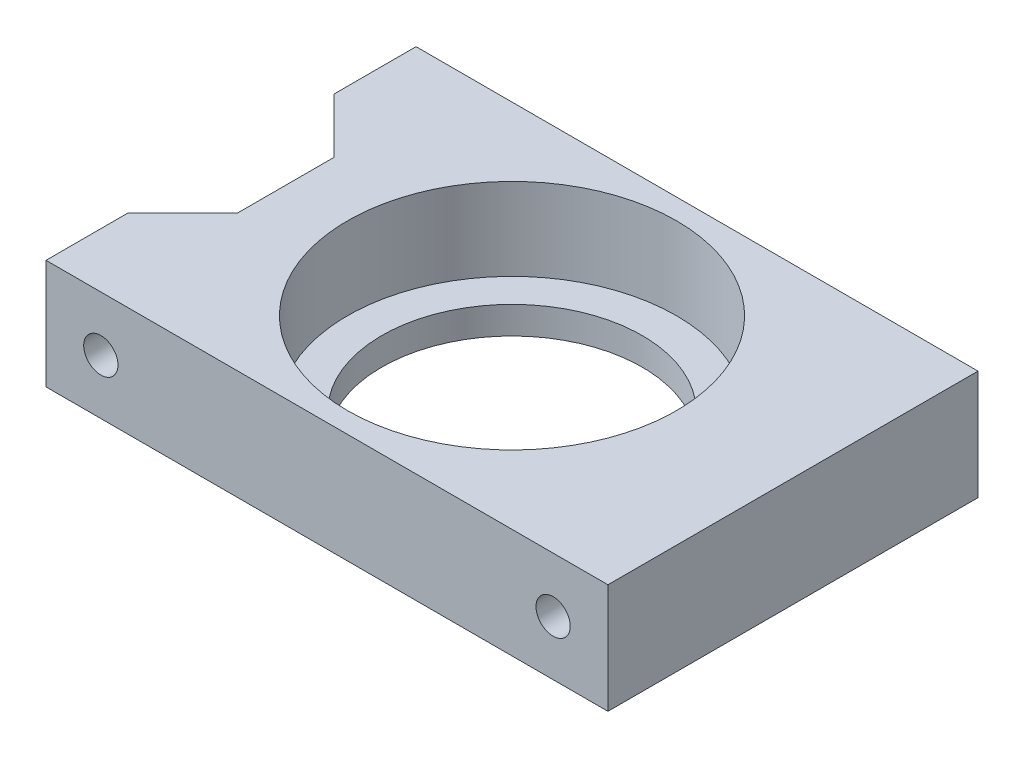
ISO-10303-21;
HEADER;
FILE_DESCRIPTION(('STEP AP214'),'2;1');
FILE_NAME('part.step','',(''),(''),'','','');
FILE_SCHEMA(('AUTOMOTIVE_DESIGN { 1 0 10303 214 1 1 1 1 }'));
ENDSEC;
DATA;
#1=APPLICATION_CONTEXT('core data for automotive mechanical design processes');
#2=APPLICATION_PROTOCOL_DEFINITION('international standard','automotive_design',2000,#1);
#3=PRODUCT_CONTEXT('',#1,'mechanical');
#4=PRODUCT('Part','Part','',(#3));
#5=PRODUCT_RELATED_PRODUCT_CATEGORY('part','',(#4));
#6=PRODUCT_DEFINITION_FORMATION('','',#4);
#7=PRODUCT_DEFINITION_CONTEXT('part definition',#1,'design');
#8=PRODUCT_DEFINITION('design','',#6,#7);
#9=PRODUCT_DEFINITION_SHAPE('','',#8);
#10=(LENGTH_UNIT() NAMED_UNIT(*) SI_UNIT(.MILLI.,.METRE.));
#11=(NAMED_UNIT(*) PLANE_ANGLE_UNIT() SI_UNIT($,.RADIAN.));
#12=(NAMED_UNIT(*) SI_UNIT($,.STERADIAN.) SOLID_ANGLE_UNIT());
#13=UNCERTAINTY_MEASURE_WITH_UNIT(LENGTH_MEASURE(1.E-05),#10,'distance_accuracy_value','');
#14=(GEOMETRIC_REPRESENTATION_CONTEXT(3) GLOBAL_UNCERTAINTY_ASSIGNED_CONTEXT((#13)) GLOBAL_UNIT_ASSIGNED_CONTEXT((#10,
#11,#12)) REPRESENTATION_CONTEXT('',''));
#15=CARTESIAN_POINT('',(0.,0.,0.));
#16=DIRECTION('',(0.,0.,1.));
#17=DIRECTION('',(1.,0.,0.));
#18=AXIS2_PLACEMENT_3D('',#15,#16,#17);
#19=CARTESIAN_POINT('',(-20.5,8.,13.5));
#20=DIRECTION('',(1.,0.,0.));
#21=DIRECTION('',(0.,0.,-1.));
#22=AXIS2_PLACEMENT_3D('',#19,#20,#21);
#23=PLANE('',#22);
#24=DIRECTION('',(0.,0.,1.));
#25=VECTOR('',#24,1.);
#26=CARTESIAN_POINT('',(-20.5,0.,13.5));
#27=LINE('',#26,#25);
#28=CARTESIAN_POINT('',(-20.5,0.,-13.5));
#29=VERTEX_POINT('',#28);
#30=CARTESIAN_POINT('',(-20.5,0.,-7.5));
#31=VERTEX_POINT('',#30);
#32=EDGE_CURVE('E171',#29,#31,#27,.T.);
#33=ORIENTED_EDGE('',*,*,#32,.T.);
#34=DIRECTION('',(0.,1.,0.));
#35=VECTOR('',#34,1.);
#36=CARTESIAN_POINT('',(-20.5,0.,-7.5));
#37=LINE('',#36,#35);
#38=CARTESIAN_POINT('',(-20.5,8.,-7.5));
#39=VERTEX_POINT('',#38);
#40=EDGE_CURVE('E143',#31,#39,#37,.T.);
#41=ORIENTED_EDGE('',*,*,#40,.T.);
#42=DIRECTION('',(0.,0.,1.));
#43=VECTOR('',#42,1.);
#44=CARTESIAN_POINT('',(-20.5,8.,13.5));
#45=LINE('',#44,#43);
#46=CARTESIAN_POINT('',(-20.5,8.,-13.5));
#47=VERTEX_POINT('',#46);
#48=EDGE_CURVE('E162',#47,#39,#45,.T.);
#49=ORIENTED_EDGE('',*,*,#48,.F.);
#50=DIRECTION('',(0.,-1.,0.));
#51=VECTOR('',#50,1.);
#52=CARTESIAN_POINT('',(-20.5,8.,-13.5));
#53=LINE('',#52,#51);
#54=EDGE_CURVE('E44',#47,#29,#53,.T.);
#55=ORIENTED_EDGE('',*,*,#54,.T.);
#56=EDGE_LOOP('',(#33,#41,#49,#55));
#57=FACE_BOUND('',#56,.T.);
#58=ADVANCED_FACE('F35',(#57),#23,.F.);
#59=CARTESIAN_POINT('',(0.,8.,0.));
#60=DIRECTION('',(0.,-1.,0.));
#61=DIRECTION('',(0.,0.,-1.));
#62=AXIS2_PLACEMENT_3D('',#59,#60,#61);
#63=CYLINDRICAL_SURFACE('',#62,9.5);
#64=CARTESIAN_POINT('',(0.,0.,0.));
#65=DIRECTION('',(0.,1.,0.));
#66=DIRECTION('',(0.,0.,1.));
#67=AXIS2_PLACEMENT_3D('',#64,#65,#66);
#68=CIRCLE('',#67,9.5);
#69=CARTESIAN_POINT('',(0.,0.,9.5));
#70=VERTEX_POINT('',#69);
#71=EDGE_CURVE('E154',#70,#70,#68,.T.);
#72=ORIENTED_EDGE('',*,*,#71,.F.);
#73=EDGE_LOOP('',(#72));
#74=FACE_BOUND('',#73,.T.);
#75=CARTESIAN_POINT('',(0.,2.,0.));
#76=DIRECTION('',(0.,1.,0.));
#77=DIRECTION('',(0.,0.,1.));
#78=AXIS2_PLACEMENT_3D('',#75,#76,#77);
#79=CIRCLE('',#78,9.5);
#80=CARTESIAN_POINT('',(0.,2.,9.5));
#81=VERTEX_POINT('',#80);
#82=EDGE_CURVE('E39',#81,#81,#79,.T.);
#83=ORIENTED_EDGE('',*,*,#82,.T.);
#84=EDGE_LOOP('',(#83));
#85=FACE_BOUND('',#84,.T.);
#86=ADVANCED_FACE('F204',(#74,#85),#63,.F.);
#87=CARTESIAN_POINT('',(0.,8.,0.));
#88=DIRECTION('',(0.,-1.,0.));
#89=DIRECTION('',(0.,0.,-1.));
#90=AXIS2_PLACEMENT_3D('',#87,#88,#89);
#91=PLANE('',#90);
#92=CARTESIAN_POINT('',(0.,8.,0.));
#93=DIRECTION('',(0.,1.,0.));
#94=DIRECTION('',(0.,0.,1.));
#95=AXIS2_PLACEMENT_3D('',#92,#93,#94);
#96=CIRCLE('',#95,12.);
#97=CARTESIAN_POINT('',(0.,8.,12.));
#98=VERTEX_POINT('',#97);
#99=EDGE_CURVE('E146',#98,#98,#96,.T.);
#100=ORIENTED_EDGE('',*,*,#99,.F.);
#101=EDGE_LOOP('',(#100));
#102=FACE_BOUND('',#101,.T.);
#103=ORIENTED_EDGE('',*,*,#48,.T.);
#104=DIRECTION('',(-0.707106781186549,0.,-0.707106781186546));
#105=VECTOR('',#104,1.);
#106=CARTESIAN_POINT('',(-20.5,8.,-7.5));
#107=LINE('',#106,#105);
#108=CARTESIAN_POINT('',(-16.5,8.,-3.5));
#109=VERTEX_POINT('',#108);
#110=EDGE_CURVE('E131',#109,#39,#107,.T.);
#111=ORIENTED_EDGE('',*,*,#110,.F.);
#112=DIRECTION('',(0.,0.,-1.));
#113=VECTOR('',#112,1.);
#114=CARTESIAN_POINT('',(-16.5,8.,-3.5));
#115=LINE('',#114,#113);
#116=CARTESIAN_POINT('',(-16.5,8.,3.5));
#117=VERTEX_POINT('',#116);
#118=EDGE_CURVE('E133',#117,#109,#115,.T.);
#119=ORIENTED_EDGE('',*,*,#118,.F.);
#120=DIRECTION('',(0.707106781186549,0.,-0.707106781186546));
#121=VECTOR('',#120,1.);
#122=CARTESIAN_POINT('',(-20.5,8.,7.5));
#123=LINE('',#122,#121);
#124=CARTESIAN_POINT('',(-20.5,8.,7.5));
#125=VERTEX_POINT('',#124);
#126=EDGE_CURVE('E112',#125,#117,#123,.T.);
#127=ORIENTED_EDGE('',*,*,#126,.F.);
#128=CARTESIAN_POINT('',(-20.5,8.,13.5));
#129=VERTEX_POINT('',#128);
#130=EDGE_CURVE('E161',#125,#129,#45,.T.);
#131=ORIENTED_EDGE('',*,*,#130,.T.);
#132=DIRECTION('',(1.,0.,0.));
#133=VECTOR('',#132,1.);
#134=CARTESIAN_POINT('',(-20.5,8.,13.5));
#135=LINE('',#134,#133);
#136=CARTESIAN_POINT('',(20.5,8.,13.5));
#137=VERTEX_POINT('',#136);
#138=EDGE_CURVE('E60',#129,#137,#135,.T.);
#139=ORIENTED_EDGE('',*,*,#138,.T.);
#140=DIRECTION('',(0.,0.,-1.));
#141=VECTOR('',#140,1.);
#142=CARTESIAN_POINT('',(20.5,8.,13.5));
#143=LINE('',#142,#141);
#144=CARTESIAN_POINT('',(20.5,8.,-13.5));
#145=VERTEX_POINT('',#144);
#146=EDGE_CURVE('E158',#137,#145,#143,.T.);
#147=ORIENTED_EDGE('',*,*,#146,.T.);
#148=DIRECTION('',(-1.,0.,0.));
#149=VECTOR('',#148,1.);
#150=CARTESIAN_POINT('',(-20.5,8.,-13.5));
#151=LINE('',#150,#149);
#152=EDGE_CURVE('E88',#145,#47,#151,.T.);
#153=ORIENTED_EDGE('',*,*,#152,.T.);
#154=EDGE_LOOP('',(#103,#111,#119,#127,#131,#139,#147,#153));
#155=FACE_BOUND('',#154,.T.);
#156=ADVANCED_FACE('F186',(#102,#155),#91,.F.);
#157=CARTESIAN_POINT('',(0.,0.,0.));
#158=DIRECTION('',(0.,-1.,0.));
#159=DIRECTION('',(0.,0.,-1.));
#160=AXIS2_PLACEMENT_3D('',#157,#158,#159);
#161=PLANE('',#160);
#162=DIRECTION('',(-0.707106781186549,0.,-0.707106781186546));
#163=VECTOR('',#162,1.);
#164=CARTESIAN_POINT('',(-20.5,0.,-7.5));
#165=LINE('',#164,#163);
#166=CARTESIAN_POINT('',(-16.5,0.,-3.5));
#167=VERTEX_POINT('',#166);
#168=EDGE_CURVE('E125',#167,#31,#165,.T.);
#169=ORIENTED_EDGE('',*,*,#168,.T.);
#170=ORIENTED_EDGE('',*,*,#32,.F.);
#171=DIRECTION('',(-1.,0.,0.));
#172=VECTOR('',#171,1.);
#173=CARTESIAN_POINT('',(-20.5,0.,-13.5));
#174=LINE('',#173,#172);
#175=CARTESIAN_POINT('',(20.5,0.,-13.5));
#176=VERTEX_POINT('',#175);
#177=EDGE_CURVE('E169',#176,#29,#174,.T.);
#178=ORIENTED_EDGE('',*,*,#177,.F.);
#179=DIRECTION('',(0.,0.,-1.));
#180=VECTOR('',#179,1.);
#181=CARTESIAN_POINT('',(20.5,0.,13.5));
#182=LINE('',#181,#180);
#183=CARTESIAN_POINT('',(20.5,0.,13.5));
#184=VERTEX_POINT('',#183);
#185=EDGE_CURVE('E157',#184,#176,#182,.T.);
#186=ORIENTED_EDGE('',*,*,#185,.F.);
#187=DIRECTION('',(1.,0.,0.));
#188=VECTOR('',#187,1.);
#189=CARTESIAN_POINT('',(-20.5,0.,13.5));
#190=LINE('',#189,#188);
#191=CARTESIAN_POINT('',(-20.5,0.,13.5));
#192=VERTEX_POINT('',#191);
#193=EDGE_CURVE('E81',#192,#184,#190,.T.);
#194=ORIENTED_EDGE('',*,*,#193,.F.);
#195=CARTESIAN_POINT('',(-20.5,0.,7.5));
#196=VERTEX_POINT('',#195);
#197=EDGE_CURVE('E130',#196,#192,#27,.T.);
#198=ORIENTED_EDGE('',*,*,#197,.F.);
#199=DIRECTION('',(0.707106781186549,0.,-0.707106781186546));
#200=VECTOR('',#199,1.);
#201=CARTESIAN_POINT('',(-20.5,0.,7.5));
#202=LINE('',#201,#200);
#203=CARTESIAN_POINT('',(-16.5,0.,3.5));
#204=VERTEX_POINT('',#203);
#205=EDGE_CURVE('E51',#196,#204,#202,.T.);
#206=ORIENTED_EDGE('',*,*,#205,.T.);
#207=DIRECTION('',(0.,0.,-1.));
#208=VECTOR('',#207,1.);
#209=CARTESIAN_POINT('',(-16.5,0.,-3.5));
#210=LINE('',#209,#208);
#211=EDGE_CURVE('E120',#204,#167,#210,.T.);
#212=ORIENTED_EDGE('',*,*,#211,.T.);
#213=EDGE_LOOP('',(#169,#170,#178,#186,#194,#198,#206,#212));
#214=FACE_BOUND('',#213,.T.);
#215=ORIENTED_EDGE('',*,*,#71,.T.);
#216=EDGE_LOOP('',(#215));
#217=FACE_BOUND('',#216,.T.);
#218=ADVANCED_FACE('F128',(#214,#217),#161,.T.);
#219=CARTESIAN_POINT('',(20.5,8.,13.5));
#220=DIRECTION('',(-1.,0.,0.));
#221=DIRECTION('',(0.,0.,1.));
#222=AXIS2_PLACEMENT_3D('',#219,#220,#221);
#223=PLANE('',#222);
#224=ORIENTED_EDGE('',*,*,#185,.T.);
#225=DIRECTION('',(0.,-1.,0.));
#226=VECTOR('',#225,1.);
#227=CARTESIAN_POINT('',(20.5,8.,-13.5));
#228=LINE('',#227,#226);
#229=EDGE_CURVE('E11',#145,#176,#228,.T.);
#230=ORIENTED_EDGE('',*,*,#229,.F.);
#231=ORIENTED_EDGE('',*,*,#146,.F.);
#232=DIRECTION('',(0.,-1.,0.));
#233=VECTOR('',#232,1.);
#234=CARTESIAN_POINT('',(20.5,8.,13.5));
#235=LINE('',#234,#233);
#236=EDGE_CURVE('E166',#137,#184,#235,.T.);
#237=ORIENTED_EDGE('',*,*,#236,.T.);
#238=EDGE_LOOP('',(#224,#230,#231,#237));
#239=FACE_BOUND('',#238,.T.);
#240=ADVANCED_FACE('F37',(#239),#223,.F.);
#241=CARTESIAN_POINT('',(-20.5,8.,-13.5));
#242=DIRECTION('',(0.,0.,1.));
#243=DIRECTION('',(1.,0.,0.));
#244=AXIS2_PLACEMENT_3D('',#241,#242,#243);
#245=PLANE('',#244);
#246=CARTESIAN_POINT('',(-16.5,4.,-13.5));
#247=DIRECTION('',(0.,0.,-1.));
#248=DIRECTION('',(1.,0.,0.));
#249=AXIS2_PLACEMENT_3D('',#246,#247,#248);
#250=CIRCLE('',#249,1.25);
#251=CARTESIAN_POINT('',(-15.25,4.,-13.5));
#252=VERTEX_POINT('',#251);
#253=EDGE_CURVE('E270',#252,#252,#250,.T.);
#254=ORIENTED_EDGE('',*,*,#253,.F.);
#255=EDGE_LOOP('',(#254));
#256=FACE_BOUND('',#255,.T.);
#257=CARTESIAN_POINT('',(16.5,4.,-13.5));
#258=DIRECTION('',(0.,0.,-1.));
#259=DIRECTION('',(-1.,0.,0.));
#260=AXIS2_PLACEMENT_3D('',#257,#258,#259);
#261=CIRCLE('',#260,1.25);
#262=CARTESIAN_POINT('',(15.25,4.,-13.5));
#263=VERTEX_POINT('',#262);
#264=EDGE_CURVE('E269',#263,#263,#261,.T.);
#265=ORIENTED_EDGE('',*,*,#264,.F.);
#266=EDGE_LOOP('',(#265));
#267=FACE_BOUND('',#266,.T.);
#268=ORIENTED_EDGE('',*,*,#177,.T.);
#269=ORIENTED_EDGE('',*,*,#54,.F.);
#270=ORIENTED_EDGE('',*,*,#152,.F.);
#271=ORIENTED_EDGE('',*,*,#229,.T.);
#272=EDGE_LOOP('',(#268,#269,#270,#271));
#273=FACE_BOUND('',#272,.T.);
#274=ADVANCED_FACE('F190',(#256,#267,#273),#245,.F.);
#275=ORIENTED_EDGE('',*,*,#130,.F.);
#276=DIRECTION('',(0.,1.,0.));
#277=VECTOR('',#276,1.);
#278=CARTESIAN_POINT('',(-20.5,0.,7.5));
#279=LINE('',#278,#277);
#280=EDGE_CURVE('E117',#196,#125,#279,.T.);
#281=ORIENTED_EDGE('',*,*,#280,.F.);
#282=ORIENTED_EDGE('',*,*,#197,.T.);
#283=DIRECTION('',(0.,-1.,0.));
#284=VECTOR('',#283,1.);
#285=CARTESIAN_POINT('',(-20.5,8.,13.5));
#286=LINE('',#285,#284);
#287=EDGE_CURVE('E176',#129,#192,#286,.T.);
#288=ORIENTED_EDGE('',*,*,#287,.F.);
#289=EDGE_LOOP('',(#275,#281,#282,#288));
#290=FACE_BOUND('',#289,.T.);
#291=ADVANCED_FACE('F192',(#290),#23,.F.);
#292=CARTESIAN_POINT('',(-20.5,8.,13.5));
#293=DIRECTION('',(0.,0.,-1.));
#294=DIRECTION('',(-1.,0.,0.));
#295=AXIS2_PLACEMENT_3D('',#292,#293,#294);
#296=PLANE('',#295);
#297=CARTESIAN_POINT('',(16.5,4.,13.5));
#298=DIRECTION('',(0.,0.,1.));
#299=DIRECTION('',(-1.,0.,0.));
#300=AXIS2_PLACEMENT_3D('',#297,#298,#299);
#301=CIRCLE('',#300,1.25);
#302=CARTESIAN_POINT('',(15.25,4.,13.5));
#303=VERTEX_POINT('',#302);
#304=EDGE_CURVE('E279',#303,#303,#301,.T.);
#305=ORIENTED_EDGE('',*,*,#304,.F.);
#306=EDGE_LOOP('',(#305));
#307=FACE_BOUND('',#306,.T.);
#308=CARTESIAN_POINT('',(-16.5,4.,13.5));
#309=DIRECTION('',(0.,0.,1.));
#310=DIRECTION('',(1.,0.,0.));
#311=AXIS2_PLACEMENT_3D('',#308,#309,#310);
#312=CIRCLE('',#311,1.25);
#313=CARTESIAN_POINT('',(-15.25,4.,13.5));
#314=VERTEX_POINT('',#313);
#315=EDGE_CURVE('E136',#314,#314,#312,.T.);
#316=ORIENTED_EDGE('',*,*,#315,.F.);
#317=EDGE_LOOP('',(#316));
#318=FACE_BOUND('',#317,.T.);
#319=ORIENTED_EDGE('',*,*,#193,.T.);
#320=ORIENTED_EDGE('',*,*,#236,.F.);
#321=ORIENTED_EDGE('',*,*,#138,.F.);
#322=ORIENTED_EDGE('',*,*,#287,.T.);
#323=EDGE_LOOP('',(#319,#320,#321,#322));
#324=FACE_BOUND('',#323,.T.);
#325=ADVANCED_FACE('F198',(#307,#318,#324),#296,.F.);
#326=CARTESIAN_POINT('',(0.,2.,0.));
#327=DIRECTION('',(0.,1.,0.));
#328=DIRECTION('',(0.,0.,1.));
#329=AXIS2_PLACEMENT_3D('',#326,#327,#328);
#330=CYLINDRICAL_SURFACE('',#329,12.);
#331=CARTESIAN_POINT('',(0.,2.,0.));
#332=DIRECTION('',(0.,1.,0.));
#333=DIRECTION('',(0.,0.,1.));
#334=AXIS2_PLACEMENT_3D('',#331,#332,#333);
#335=CIRCLE('',#334,12.);
#336=CARTESIAN_POINT('',(0.,2.,12.));
#337=VERTEX_POINT('',#336);
#338=EDGE_CURVE('E149',#337,#337,#335,.T.);
#339=ORIENTED_EDGE('',*,*,#338,.F.);
#340=EDGE_LOOP('',(#339));
#341=FACE_BOUND('',#340,.T.);
#342=ORIENTED_EDGE('',*,*,#99,.T.);
#343=EDGE_LOOP('',(#342));
#344=FACE_BOUND('',#343,.T.);
#345=ADVANCED_FACE('F213',(#341,#344),#330,.F.);
#346=CARTESIAN_POINT('',(0.,2.,0.));
#347=DIRECTION('',(0.,1.,0.));
#348=DIRECTION('',(0.,0.,1.));
#349=AXIS2_PLACEMENT_3D('',#346,#347,#348);
#350=PLANE('',#349);
#351=ORIENTED_EDGE('',*,*,#82,.F.);
#352=EDGE_LOOP('',(#351));
#353=FACE_BOUND('',#352,.T.);
#354=ORIENTED_EDGE('',*,*,#338,.T.);
#355=EDGE_LOOP('',(#354));
#356=FACE_BOUND('',#355,.T.);
#357=ADVANCED_FACE('F222',(#353,#356),#350,.T.);
#358=CARTESIAN_POINT('',(-20.5,0.,-7.5));
#359=DIRECTION('',(0.707106781186546,0.,-0.707106781186549));
#360=DIRECTION('',(-0.707106781186549,0.,-0.707106781186546));
#361=AXIS2_PLACEMENT_3D('',#358,#359,#360);
#362=PLANE('',#361);
#363=ORIENTED_EDGE('',*,*,#110,.T.);
#364=ORIENTED_EDGE('',*,*,#40,.F.);
#365=ORIENTED_EDGE('',*,*,#168,.F.);
#366=DIRECTION('',(0.,1.,0.));
#367=VECTOR('',#366,1.);
#368=CARTESIAN_POINT('',(-16.5,0.,-3.5));
#369=LINE('',#368,#367);
#370=EDGE_CURVE('E116',#167,#109,#369,.T.);
#371=ORIENTED_EDGE('',*,*,#370,.T.);
#372=EDGE_LOOP('',(#363,#364,#365,#371));
#373=FACE_BOUND('',#372,.T.);
#374=ADVANCED_FACE('F184',(#373),#362,.F.);
#375=CARTESIAN_POINT('',(-16.5,0.,-3.5));
#376=DIRECTION('',(1.,0.,0.));
#377=DIRECTION('',(0.,0.,-1.));
#378=AXIS2_PLACEMENT_3D('',#375,#376,#377);
#379=PLANE('',#378);
#380=ORIENTED_EDGE('',*,*,#118,.T.);
#381=ORIENTED_EDGE('',*,*,#370,.F.);
#382=ORIENTED_EDGE('',*,*,#211,.F.);
#383=DIRECTION('',(0.,1.,0.));
#384=VECTOR('',#383,1.);
#385=CARTESIAN_POINT('',(-16.5,0.,3.5));
#386=LINE('',#385,#384);
#387=EDGE_CURVE('E108',#204,#117,#386,.T.);
#388=ORIENTED_EDGE('',*,*,#387,.T.);
#389=EDGE_LOOP('',(#380,#381,#382,#388));
#390=FACE_BOUND('',#389,.T.);
#391=ADVANCED_FACE('F121',(#390),#379,.F.);
#392=CARTESIAN_POINT('',(-20.5,0.,7.5));
#393=DIRECTION('',(0.707106781186546,0.,0.707106781186549));
#394=DIRECTION('',(0.707106781186549,0.,-0.707106781186546));
#395=AXIS2_PLACEMENT_3D('',#392,#393,#394);
#396=PLANE('',#395);
#397=ORIENTED_EDGE('',*,*,#126,.T.);
#398=ORIENTED_EDGE('',*,*,#387,.F.);
#399=ORIENTED_EDGE('',*,*,#205,.F.);
#400=ORIENTED_EDGE('',*,*,#280,.T.);
#401=EDGE_LOOP('',(#397,#398,#399,#400));
#402=FACE_BOUND('',#401,.T.);
#403=ADVANCED_FACE('F110',(#402),#396,.F.);
#404=CARTESIAN_POINT('',(-16.5,4.,6.5));
#405=DIRECTION('',(0.,0.,1.));
#406=DIRECTION('',(1.,0.,0.));
#407=AXIS2_PLACEMENT_3D('',#404,#405,#406);
#408=CYLINDRICAL_SURFACE('',#407,1.25);
#409=CARTESIAN_POINT('',(-16.5,4.,6.5));
#410=DIRECTION('',(0.,0.,1.));
#411=DIRECTION('',(1.,0.,0.));
#412=AXIS2_PLACEMENT_3D('',#409,#410,#411);
#413=CIRCLE('',#412,1.25);
#414=CARTESIAN_POINT('',(-15.25,4.,6.5));
#415=VERTEX_POINT('',#414);
#416=EDGE_CURVE('E141',#415,#415,#413,.T.);
#417=ORIENTED_EDGE('',*,*,#416,.F.);
#418=EDGE_LOOP('',(#417));
#419=FACE_BOUND('',#418,.T.);
#420=ORIENTED_EDGE('',*,*,#315,.T.);
#421=EDGE_LOOP('',(#420));
#422=FACE_BOUND('',#421,.T.);
#423=ADVANCED_FACE('F229',(#419,#422),#408,.F.);
#424=CARTESIAN_POINT('',(-16.5,4.,6.5));
#425=DIRECTION('',(0.,0.,1.));
#426=DIRECTION('',(1.,0.,0.));
#427=AXIS2_PLACEMENT_3D('',#424,#425,#426);
#428=PLANE('',#427);
#429=ORIENTED_EDGE('',*,*,#416,.T.);
#430=EDGE_LOOP('',(#429));
#431=FACE_BOUND('',#430,.T.);
#432=ADVANCED_FACE('F236',(#431),#428,.T.);
#433=CARTESIAN_POINT('',(16.5,4.,6.5));
#434=DIRECTION('',(0.,0.,1.));
#435=DIRECTION('',(1.,0.,0.));
#436=AXIS2_PLACEMENT_3D('',#433,#434,#435);
#437=CYLINDRICAL_SURFACE('',#436,1.25);
#438=CARTESIAN_POINT('',(16.5,4.,6.5));
#439=DIRECTION('',(0.,0.,1.));
#440=DIRECTION('',(-1.,0.,0.));
#441=AXIS2_PLACEMENT_3D('',#438,#439,#440);
#442=CIRCLE('',#441,1.25);
#443=CARTESIAN_POINT('',(15.25,4.,6.5));
#444=VERTEX_POINT('',#443);
#445=EDGE_CURVE('E281',#444,#444,#442,.T.);
#446=ORIENTED_EDGE('',*,*,#445,.F.);
#447=EDGE_LOOP('',(#446));
#448=FACE_BOUND('',#447,.T.);
#449=ORIENTED_EDGE('',*,*,#304,.T.);
#450=EDGE_LOOP('',(#449));
#451=FACE_BOUND('',#450,.T.);
#452=ADVANCED_FACE('F240',(#448,#451),#437,.F.);
#453=CARTESIAN_POINT('',(16.5,4.,6.5));
#454=DIRECTION('',(0.,0.,-1.));
#455=DIRECTION('',(-1.,0.,0.));
#456=AXIS2_PLACEMENT_3D('',#453,#454,#455);
#457=PLANE('',#456);
#458=ORIENTED_EDGE('',*,*,#445,.T.);
#459=EDGE_LOOP('',(#458));
#460=FACE_BOUND('',#459,.T.);
#461=ADVANCED_FACE('F244',(#460),#457,.F.);
#462=CARTESIAN_POINT('',(16.5,4.,-6.5));
#463=DIRECTION('',(0.,0.,-1.));
#464=DIRECTION('',(-1.,0.,0.));
#465=AXIS2_PLACEMENT_3D('',#462,#463,#464);
#466=CYLINDRICAL_SURFACE('',#465,1.25);
#467=CARTESIAN_POINT('',(16.5,4.,-6.5));
#468=DIRECTION('',(0.,0.,-1.));
#469=DIRECTION('',(-1.,0.,0.));
#470=AXIS2_PLACEMENT_3D('',#467,#468,#469);
#471=CIRCLE('',#470,1.25);
#472=CARTESIAN_POINT('',(15.25,4.,-6.5));
#473=VERTEX_POINT('',#472);
#474=EDGE_CURVE('E273',#473,#473,#471,.T.);
#475=ORIENTED_EDGE('',*,*,#474,.F.);
#476=EDGE_LOOP('',(#475));
#477=FACE_BOUND('',#476,.T.);
#478=ORIENTED_EDGE('',*,*,#264,.T.);
#479=EDGE_LOOP('',(#478));
#480=FACE_BOUND('',#479,.T.);
#481=ADVANCED_FACE('F248',(#477,#480),#466,.F.);
#482=CARTESIAN_POINT('',(16.5,4.,-6.5));
#483=DIRECTION('',(0.,0.,-1.));
#484=DIRECTION('',(-1.,0.,0.));
#485=AXIS2_PLACEMENT_3D('',#482,#483,#484);
#486=PLANE('',#485);
#487=ORIENTED_EDGE('',*,*,#474,.T.);
#488=EDGE_LOOP('',(#487));
#489=FACE_BOUND('',#488,.T.);
#490=ADVANCED_FACE('F252',(#489),#486,.T.);
#491=CARTESIAN_POINT('',(-16.5,4.,-6.5));
#492=DIRECTION('',(0.,0.,-1.));
#493=DIRECTION('',(-1.,0.,0.));
#494=AXIS2_PLACEMENT_3D('',#491,#492,#493);
#495=CYLINDRICAL_SURFACE('',#494,1.25);
#496=CARTESIAN_POINT('',(-16.5,4.,-6.5));
#497=DIRECTION('',(0.,0.,-1.));
#498=DIRECTION('',(1.,0.,0.));
#499=AXIS2_PLACEMENT_3D('',#496,#497,#498);
#500=CIRCLE('',#499,1.25);
#501=CARTESIAN_POINT('',(-15.25,4.,-6.5));
#502=VERTEX_POINT('',#501);
#503=EDGE_CURVE('E268',#502,#502,#500,.T.);
#504=ORIENTED_EDGE('',*,*,#503,.F.);
#505=EDGE_LOOP('',(#504));
#506=FACE_BOUND('',#505,.T.);
#507=ORIENTED_EDGE('',*,*,#253,.T.);
#508=EDGE_LOOP('',(#507));
#509=FACE_BOUND('',#508,.T.);
#510=ADVANCED_FACE('F256',(#506,#509),#495,.F.);
#511=CARTESIAN_POINT('',(-16.5,4.,-6.5));
#512=DIRECTION('',(0.,0.,1.));
#513=DIRECTION('',(1.,0.,0.));
#514=AXIS2_PLACEMENT_3D('',#511,#512,#513);
#515=PLANE('',#514);
#516=ORIENTED_EDGE('',*,*,#503,.T.);
#517=EDGE_LOOP('',(#516));
#518=FACE_BOUND('',#517,.T.);
#519=ADVANCED_FACE('F260',(#518),#515,.F.);
#520=CLOSED_SHELL('',(#58,#86,#156,#218,#240,#274,#291,#325,#345,#357,#374,#391,#403,#423,#432,
#452,#461,#481,#490,#510,#519));
#521=MANIFOLD_SOLID_BREP('B2',#520);
#522=ADVANCED_BREP_SHAPE_REPRESENTATION('',(#18,#521),#14);
#523=SHAPE_DEFINITION_REPRESENTATION(#9,#522);
ENDSEC;
END-ISO-10303-21;
